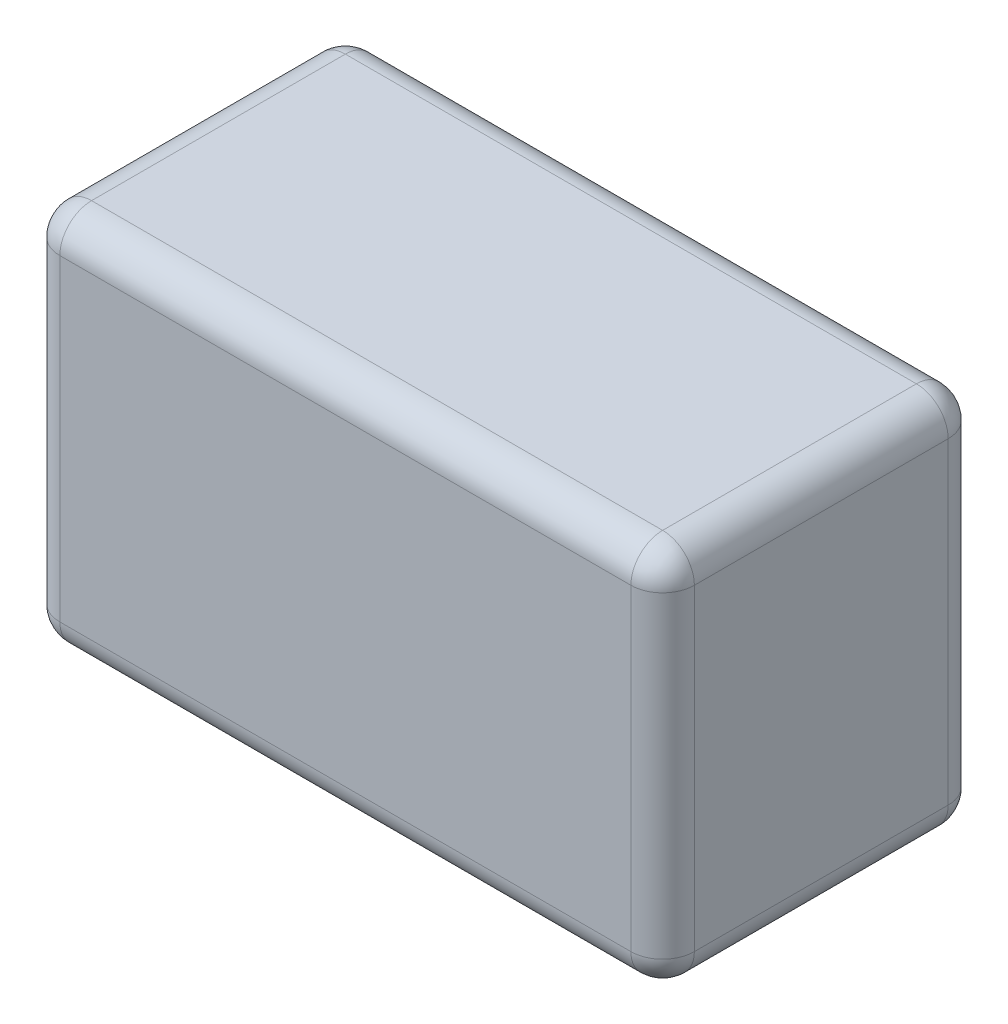
ISO-10303-21;
HEADER;
FILE_DESCRIPTION(('STEP AP214'),'2;1');
FILE_NAME('part.step','',(''),(''),'','','');
FILE_SCHEMA(('AUTOMOTIVE_DESIGN { 1 0 10303 214 1 1 1 1 }'));
ENDSEC;
DATA;
#1=APPLICATION_CONTEXT('core data for automotive mechanical design processes');
#2=APPLICATION_PROTOCOL_DEFINITION('international standard','automotive_design',2000,#1);
#3=PRODUCT_CONTEXT('',#1,'mechanical');
#4=PRODUCT('Part','Part','',(#3));
#5=PRODUCT_RELATED_PRODUCT_CATEGORY('part','',(#4));
#6=PRODUCT_DEFINITION_FORMATION('','',#4);
#7=PRODUCT_DEFINITION_CONTEXT('part definition',#1,'design');
#8=PRODUCT_DEFINITION('design','',#6,#7);
#9=PRODUCT_DEFINITION_SHAPE('','',#8);
#10=(LENGTH_UNIT() NAMED_UNIT(*) SI_UNIT(.MILLI.,.METRE.));
#11=(NAMED_UNIT(*) PLANE_ANGLE_UNIT() SI_UNIT($,.RADIAN.));
#12=(NAMED_UNIT(*) SI_UNIT($,.STERADIAN.) SOLID_ANGLE_UNIT());
#13=UNCERTAINTY_MEASURE_WITH_UNIT(LENGTH_MEASURE(1.E-05),#10,'distance_accuracy_value','');
#14=(GEOMETRIC_REPRESENTATION_CONTEXT(3) GLOBAL_UNCERTAINTY_ASSIGNED_CONTEXT((#13)) GLOBAL_UNIT_ASSIGNED_CONTEXT((#10,
#11,#12)) REPRESENTATION_CONTEXT('',''));
#15=CARTESIAN_POINT('',(0.,0.,0.));
#16=DIRECTION('',(0.,0.,1.));
#17=DIRECTION('',(1.,0.,0.));
#18=AXIS2_PLACEMENT_3D('',#15,#16,#17);
#19=CARTESIAN_POINT('',(0.45,0.55,0.2));
#20=DIRECTION('',(1.,0.,0.));
#21=DIRECTION('',(0.,0.,-1.));
#22=AXIS2_PLACEMENT_3D('',#19,#20,#21);
#23=SPHERICAL_SURFACE('',#22,0.05);
#24=CARTESIAN_POINT('',(0.45,0.55,0.2));
#25=DIRECTION('',(0.,-1.,0.));
#26=DIRECTION('',(0.,0.,-1.));
#27=AXIS2_PLACEMENT_3D('',#24,#25,#26);
#28=CIRCLE('',#27,0.05);
#29=CARTESIAN_POINT('',(0.5,0.55,0.2));
#30=VERTEX_POINT('',#29);
#31=CARTESIAN_POINT('',(0.45,0.55,0.25));
#32=VERTEX_POINT('',#31);
#33=EDGE_CURVE('E122',#30,#32,#28,.T.);
#34=ORIENTED_EDGE('',*,*,#33,.F.);
#35=CARTESIAN_POINT('',(0.45,0.55,0.2));
#36=DIRECTION('',(0.,0.,-1.));
#37=DIRECTION('',(-1.,0.,0.));
#38=AXIS2_PLACEMENT_3D('',#35,#36,#37);
#39=CIRCLE('',#38,0.05);
#40=CARTESIAN_POINT('',(0.45,0.6,0.2));
#41=VERTEX_POINT('',#40);
#42=EDGE_CURVE('E131',#41,#30,#39,.T.);
#43=ORIENTED_EDGE('',*,*,#42,.F.);
#44=CARTESIAN_POINT('',(0.45,0.55,0.2));
#45=DIRECTION('',(1.,0.,0.));
#46=DIRECTION('',(0.,0.,-1.));
#47=AXIS2_PLACEMENT_3D('',#44,#45,#46);
#48=CIRCLE('',#47,0.05);
#49=EDGE_CURVE('E111',#32,#41,#48,.F.);
#50=ORIENTED_EDGE('',*,*,#49,.F.);
#51=EDGE_LOOP('',(#34,#43,#50));
#52=FACE_BOUND('',#51,.T.);
#53=ADVANCED_FACE('F17',(#52),#23,.T.);
#54=CARTESIAN_POINT('',(-0.45,0.55,0.2));
#55=DIRECTION('',(1.,0.,0.));
#56=DIRECTION('',(0.,0.,-1.));
#57=AXIS2_PLACEMENT_3D('',#54,#55,#56);
#58=SPHERICAL_SURFACE('',#57,0.05);
#59=CARTESIAN_POINT('',(-0.45,0.55,0.2));
#60=DIRECTION('',(0.,-1.,0.));
#61=DIRECTION('',(0.,0.,-1.));
#62=AXIS2_PLACEMENT_3D('',#59,#60,#61);
#63=CIRCLE('',#62,0.05);
#64=CARTESIAN_POINT('',(-0.45,0.549999999999904,0.25));
#65=VERTEX_POINT('',#64);
#66=CARTESIAN_POINT('',(-0.5,0.55,0.2));
#67=VERTEX_POINT('',#66);
#68=EDGE_CURVE('E264',#65,#67,#63,.T.);
#69=ORIENTED_EDGE('',*,*,#68,.F.);
#70=CARTESIAN_POINT('',(-0.45,0.55,0.2));
#71=DIRECTION('',(1.,0.,0.));
#72=DIRECTION('',(0.,0.,-1.));
#73=AXIS2_PLACEMENT_3D('',#70,#71,#72);
#74=CIRCLE('',#73,0.05);
#75=CARTESIAN_POINT('',(-0.45,0.6,0.2));
#76=VERTEX_POINT('',#75);
#77=EDGE_CURVE('E114',#76,#65,#74,.T.);
#78=ORIENTED_EDGE('',*,*,#77,.F.);
#79=CARTESIAN_POINT('',(-0.45,0.55,0.2));
#80=DIRECTION('',(0.,0.,1.));
#81=DIRECTION('',(1.,0.,0.));
#82=AXIS2_PLACEMENT_3D('',#79,#80,#81);
#83=CIRCLE('',#82,0.05);
#84=EDGE_CURVE('E255',#67,#76,#83,.F.);
#85=ORIENTED_EDGE('',*,*,#84,.F.);
#86=EDGE_LOOP('',(#69,#78,#85));
#87=FACE_BOUND('',#86,.T.);
#88=ADVANCED_FACE('F151',(#87),#58,.T.);
#89=CARTESIAN_POINT('',(-0.45,0.05,0.2));
#90=DIRECTION('',(1.,0.,0.));
#91=DIRECTION('',(0.,0.,-1.));
#92=AXIS2_PLACEMENT_3D('',#89,#90,#91);
#93=SPHERICAL_SURFACE('',#92,0.05);
#94=CARTESIAN_POINT('',(-0.45,0.05,0.2));
#95=DIRECTION('',(0.,-1.,0.));
#96=DIRECTION('',(0.,0.,-1.));
#97=AXIS2_PLACEMENT_3D('',#94,#95,#96);
#98=CIRCLE('',#97,0.05);
#99=CARTESIAN_POINT('',(-0.5,0.05,0.2));
#100=VERTEX_POINT('',#99);
#101=CARTESIAN_POINT('',(-0.45,0.05,0.25));
#102=VERTEX_POINT('',#101);
#103=EDGE_CURVE('E261',#100,#102,#98,.F.);
#104=ORIENTED_EDGE('',*,*,#103,.F.);
#105=CARTESIAN_POINT('',(-0.45,0.05,0.2));
#106=DIRECTION('',(0.,0.,-1.));
#107=DIRECTION('',(-1.,0.,0.));
#108=AXIS2_PLACEMENT_3D('',#105,#106,#107);
#109=CIRCLE('',#108,0.05);
#110=CARTESIAN_POINT('',(-0.45,0.,0.199999999999952));
#111=VERTEX_POINT('',#110);
#112=EDGE_CURVE('E253',#111,#100,#109,.T.);
#113=ORIENTED_EDGE('',*,*,#112,.F.);
#114=CARTESIAN_POINT('',(-0.45,0.05,0.2));
#115=DIRECTION('',(-1.,0.,0.));
#116=DIRECTION('',(0.,0.,1.));
#117=AXIS2_PLACEMENT_3D('',#114,#115,#116);
#118=CIRCLE('',#117,0.05);
#119=EDGE_CURVE('E247',#102,#111,#118,.F.);
#120=ORIENTED_EDGE('',*,*,#119,.F.);
#121=EDGE_LOOP('',(#104,#113,#120));
#122=FACE_BOUND('',#121,.T.);
#123=ADVANCED_FACE('F147',(#122),#93,.T.);
#124=CARTESIAN_POINT('',(0.45,0.05,0.2));
#125=DIRECTION('',(1.,0.,0.));
#126=DIRECTION('',(0.,0.,-1.));
#127=AXIS2_PLACEMENT_3D('',#124,#125,#126);
#128=SPHERICAL_SURFACE('',#127,0.05);
#129=CARTESIAN_POINT('',(0.45,0.05,0.2));
#130=DIRECTION('',(-1.,0.,0.));
#131=DIRECTION('',(0.,0.,1.));
#132=AXIS2_PLACEMENT_3D('',#129,#130,#131);
#133=CIRCLE('',#132,0.05);
#134=CARTESIAN_POINT('',(0.45,0.,0.2));
#135=VERTEX_POINT('',#134);
#136=CARTESIAN_POINT('',(0.45,0.050000000000006,0.25));
#137=VERTEX_POINT('',#136);
#138=EDGE_CURVE('E245',#135,#137,#133,.T.);
#139=ORIENTED_EDGE('',*,*,#138,.F.);
#140=CARTESIAN_POINT('',(0.45,0.05,0.2));
#141=DIRECTION('',(0.,0.,1.));
#142=DIRECTION('',(1.,0.,0.));
#143=AXIS2_PLACEMENT_3D('',#140,#141,#142);
#144=CIRCLE('',#143,0.05);
#145=CARTESIAN_POINT('',(0.5,0.05,0.2));
#146=VERTEX_POINT('',#145);
#147=EDGE_CURVE('E250',#146,#135,#144,.F.);
#148=ORIENTED_EDGE('',*,*,#147,.F.);
#149=CARTESIAN_POINT('',(0.45,0.05,0.2));
#150=DIRECTION('',(0.,-1.,0.));
#151=DIRECTION('',(0.,0.,-1.));
#152=AXIS2_PLACEMENT_3D('',#149,#150,#151);
#153=CIRCLE('',#152,0.05);
#154=EDGE_CURVE('E133',#137,#146,#153,.F.);
#155=ORIENTED_EDGE('',*,*,#154,.F.);
#156=EDGE_LOOP('',(#139,#148,#155));
#157=FACE_BOUND('',#156,.T.);
#158=ADVANCED_FACE('F143',(#157),#128,.T.);
#159=CARTESIAN_POINT('',(0.45,0.6,0.2));
#160=DIRECTION('',(0.,-1.,0.));
#161=DIRECTION('',(0.,0.,-1.));
#162=AXIS2_PLACEMENT_3D('',#159,#160,#161);
#163=CYLINDRICAL_SURFACE('',#162,0.05);
#164=ORIENTED_EDGE('',*,*,#154,.T.);
#165=DIRECTION('',(0.,1.,0.));
#166=VECTOR('',#165,1.);
#167=CARTESIAN_POINT('',(0.5,0.6,0.2));
#168=LINE('',#167,#166);
#169=EDGE_CURVE('E127',#146,#30,#168,.T.);
#170=ORIENTED_EDGE('',*,*,#169,.T.);
#171=ORIENTED_EDGE('',*,*,#33,.T.);
#172=DIRECTION('',(0.,-1.,0.));
#173=VECTOR('',#172,1.);
#174=CARTESIAN_POINT('',(0.45,0.6,0.25));
#175=LINE('',#174,#173);
#176=EDGE_CURVE('E124',#32,#137,#175,.T.);
#177=ORIENTED_EDGE('',*,*,#176,.T.);
#178=EDGE_LOOP('',(#164,#170,#171,#177));
#179=FACE_BOUND('',#178,.T.);
#180=ADVANCED_FACE('F123',(#179),#163,.T.);
#181=CARTESIAN_POINT('',(0.45,0.55,-0.25));
#182=DIRECTION('',(0.,0.,-1.));
#183=DIRECTION('',(-1.,0.,0.));
#184=AXIS2_PLACEMENT_3D('',#181,#182,#183);
#185=CYLINDRICAL_SURFACE('',#184,0.05);
#186=CARTESIAN_POINT('',(0.45,0.55,-0.2));
#187=DIRECTION('',(0.,0.,1.));
#188=DIRECTION('',(1.,0.,0.));
#189=AXIS2_PLACEMENT_3D('',#186,#187,#188);
#190=CIRCLE('',#189,0.05);
#191=CARTESIAN_POINT('',(0.45,0.6,-0.2));
#192=VERTEX_POINT('',#191);
#193=CARTESIAN_POINT('',(0.5,0.55,-0.2));
#194=VERTEX_POINT('',#193);
#195=EDGE_CURVE('E236',#192,#194,#190,.F.);
#196=ORIENTED_EDGE('',*,*,#195,.F.);
#197=DIRECTION('',(0.,0.,-1.));
#198=VECTOR('',#197,1.);
#199=CARTESIAN_POINT('',(0.45,0.6,-0.25));
#200=LINE('',#199,#198);
#201=EDGE_CURVE('E116',#192,#41,#200,.F.);
#202=ORIENTED_EDGE('',*,*,#201,.T.);
#203=ORIENTED_EDGE('',*,*,#42,.T.);
#204=DIRECTION('',(0.,0.,1.));
#205=VECTOR('',#204,1.);
#206=CARTESIAN_POINT('',(0.5,0.55,0.25));
#207=LINE('',#206,#205);
#208=EDGE_CURVE('E117',#30,#194,#207,.F.);
#209=ORIENTED_EDGE('',*,*,#208,.T.);
#210=EDGE_LOOP('',(#196,#202,#203,#209));
#211=FACE_BOUND('',#210,.T.);
#212=ADVANCED_FACE('F269',(#211),#185,.T.);
#213=CARTESIAN_POINT('',(-0.45,0.6,0.2));
#214=DIRECTION('',(0.,-1.,0.));
#215=DIRECTION('',(0.,0.,-1.));
#216=AXIS2_PLACEMENT_3D('',#213,#214,#215);
#217=CYLINDRICAL_SURFACE('',#216,0.05);
#218=ORIENTED_EDGE('',*,*,#103,.T.);
#219=DIRECTION('',(0.,-1.,0.));
#220=VECTOR('',#219,1.);
#221=CARTESIAN_POINT('',(-0.45,0.6,0.25));
#222=LINE('',#221,#220);
#223=EDGE_CURVE('E258',#102,#65,#222,.F.);
#224=ORIENTED_EDGE('',*,*,#223,.T.);
#225=ORIENTED_EDGE('',*,*,#68,.T.);
#226=DIRECTION('',(0.,1.,0.));
#227=VECTOR('',#226,1.);
#228=CARTESIAN_POINT('',(-0.5,0.6,0.2));
#229=LINE('',#228,#227);
#230=EDGE_CURVE('E353',#67,#100,#229,.F.);
#231=ORIENTED_EDGE('',*,*,#230,.T.);
#232=EDGE_LOOP('',(#218,#224,#225,#231));
#233=FACE_BOUND('',#232,.T.);
#234=ADVANCED_FACE('F358',(#233),#217,.T.);
#235=CARTESIAN_POINT('',(-0.45,0.55,-0.25));
#236=DIRECTION('',(0.,0.,1.));
#237=DIRECTION('',(1.,0.,0.));
#238=AXIS2_PLACEMENT_3D('',#235,#236,#237);
#239=CYLINDRICAL_SURFACE('',#238,0.05);
#240=CARTESIAN_POINT('',(-0.45,0.55,-0.2));
#241=DIRECTION('',(0.,0.,1.));
#242=DIRECTION('',(1.,0.,0.));
#243=AXIS2_PLACEMENT_3D('',#240,#241,#242);
#244=CIRCLE('',#243,0.05);
#245=CARTESIAN_POINT('',(-0.5,0.55,-0.2));
#246=VERTEX_POINT('',#245);
#247=CARTESIAN_POINT('',(-0.45,0.6,-0.2));
#248=VERTEX_POINT('',#247);
#249=EDGE_CURVE('E213',#246,#248,#244,.F.);
#250=ORIENTED_EDGE('',*,*,#249,.F.);
#251=DIRECTION('',(0.,0.,-1.));
#252=VECTOR('',#251,1.);
#253=CARTESIAN_POINT('',(-0.5,0.55,0.25));
#254=LINE('',#253,#252);
#255=EDGE_CURVE('E355',#246,#67,#254,.F.);
#256=ORIENTED_EDGE('',*,*,#255,.T.);
#257=ORIENTED_EDGE('',*,*,#84,.T.);
#258=DIRECTION('',(0.,0.,-1.));
#259=VECTOR('',#258,1.);
#260=CARTESIAN_POINT('',(-0.45,0.6,-0.25));
#261=LINE('',#260,#259);
#262=EDGE_CURVE('E234',#76,#248,#261,.T.);
#263=ORIENTED_EDGE('',*,*,#262,.T.);
#264=EDGE_LOOP('',(#250,#256,#257,#263));
#265=FACE_BOUND('',#264,.T.);
#266=ADVANCED_FACE('F361',(#265),#239,.T.);
#267=CARTESIAN_POINT('',(-0.45,0.05,0.25));
#268=DIRECTION('',(0.,0.,-1.));
#269=DIRECTION('',(-1.,0.,0.));
#270=AXIS2_PLACEMENT_3D('',#267,#268,#269);
#271=CYLINDRICAL_SURFACE('',#270,0.05);
#272=CARTESIAN_POINT('',(-0.45,0.05,-0.2));
#273=DIRECTION('',(0.,0.,-1.));
#274=DIRECTION('',(1.,0.,0.));
#275=AXIS2_PLACEMENT_3D('',#272,#273,#274);
#276=CIRCLE('',#275,0.05);
#277=CARTESIAN_POINT('',(-0.45,0.,-0.2));
#278=VERTEX_POINT('',#277);
#279=CARTESIAN_POINT('',(-0.5,0.05,-0.2));
#280=VERTEX_POINT('',#279);
#281=EDGE_CURVE('E209',#278,#280,#276,.T.);
#282=ORIENTED_EDGE('',*,*,#281,.F.);
#283=DIRECTION('',(0.,0.,-1.));
#284=VECTOR('',#283,1.);
#285=CARTESIAN_POINT('',(-0.45,0.,-0.25));
#286=LINE('',#285,#284);
#287=EDGE_CURVE('E205',#111,#278,#286,.T.);
#288=ORIENTED_EDGE('',*,*,#287,.F.);
#289=ORIENTED_EDGE('',*,*,#112,.T.);
#290=DIRECTION('',(0.,0.,-1.));
#291=VECTOR('',#290,1.);
#292=CARTESIAN_POINT('',(-0.5,0.05,0.25));
#293=LINE('',#292,#291);
#294=EDGE_CURVE('E307',#100,#280,#293,.T.);
#295=ORIENTED_EDGE('',*,*,#294,.T.);
#296=EDGE_LOOP('',(#282,#288,#289,#295));
#297=FACE_BOUND('',#296,.T.);
#298=ADVANCED_FACE('F305',(#297),#271,.T.);
#299=CARTESIAN_POINT('',(0.45,0.05,0.25));
#300=DIRECTION('',(0.,0.,1.));
#301=DIRECTION('',(1.,0.,0.));
#302=AXIS2_PLACEMENT_3D('',#299,#300,#301);
#303=CYLINDRICAL_SURFACE('',#302,0.05);
#304=CARTESIAN_POINT('',(0.45,0.05,-0.2));
#305=DIRECTION('',(0.,-1.91687272673274E-12,-1.));
#306=DIRECTION('',(1.,0.,0.));
#307=AXIS2_PLACEMENT_3D('',#304,#305,#306);
#308=CIRCLE('',#307,0.05);
#309=CARTESIAN_POINT('',(0.5,0.05,-0.2));
#310=VERTEX_POINT('',#309);
#311=CARTESIAN_POINT('',(0.45,0.,-0.199999999999988));
#312=VERTEX_POINT('',#311);
#313=EDGE_CURVE('E207',#310,#312,#308,.T.);
#314=ORIENTED_EDGE('',*,*,#313,.F.);
#315=DIRECTION('',(0.,0.,1.));
#316=VECTOR('',#315,1.);
#317=CARTESIAN_POINT('',(0.5,0.05,0.25));
#318=LINE('',#317,#316);
#319=EDGE_CURVE('E242',#310,#146,#318,.T.);
#320=ORIENTED_EDGE('',*,*,#319,.T.);
#321=ORIENTED_EDGE('',*,*,#147,.T.);
#322=DIRECTION('',(0.,0.,-1.));
#323=VECTOR('',#322,1.);
#324=CARTESIAN_POINT('',(0.45,0.,-0.25));
#325=LINE('',#324,#323);
#326=EDGE_CURVE('E294',#312,#135,#325,.F.);
#327=ORIENTED_EDGE('',*,*,#326,.F.);
#328=EDGE_LOOP('',(#314,#320,#321,#327));
#329=FACE_BOUND('',#328,.T.);
#330=ADVANCED_FACE('F344',(#329),#303,.T.);
#331=CARTESIAN_POINT('',(-0.5,0.6,0.25));
#332=DIRECTION('',(0.,0.,-1.));
#333=DIRECTION('',(-1.,0.,0.));
#334=AXIS2_PLACEMENT_3D('',#331,#332,#333);
#335=PLANE('',#334);
#336=DIRECTION('',(1.,0.,0.));
#337=VECTOR('',#336,1.);
#338=CARTESIAN_POINT('',(0.5,0.55,0.25));
#339=LINE('',#338,#337);
#340=EDGE_CURVE('E107',#65,#32,#339,.T.);
#341=ORIENTED_EDGE('',*,*,#340,.F.);
#342=ORIENTED_EDGE('',*,*,#223,.F.);
#343=DIRECTION('',(-1.,0.,0.));
#344=VECTOR('',#343,1.);
#345=CARTESIAN_POINT('',(-0.5,0.05,0.25));
#346=LINE('',#345,#344);
#347=EDGE_CURVE('E101',#137,#102,#346,.T.);
#348=ORIENTED_EDGE('',*,*,#347,.F.);
#349=ORIENTED_EDGE('',*,*,#176,.F.);
#350=EDGE_LOOP('',(#341,#342,#348,#349));
#351=FACE_BOUND('',#350,.T.);
#352=ADVANCED_FACE('F135',(#351),#335,.F.);
#353=CARTESIAN_POINT('',(0.5,0.6,0.25));
#354=DIRECTION('',(-1.,0.,0.));
#355=DIRECTION('',(0.,0.,1.));
#356=AXIS2_PLACEMENT_3D('',#353,#354,#355);
#357=PLANE('',#356);
#358=ORIENTED_EDGE('',*,*,#208,.F.);
#359=ORIENTED_EDGE('',*,*,#169,.F.);
#360=ORIENTED_EDGE('',*,*,#319,.F.);
#361=DIRECTION('',(0.,-1.,0.));
#362=VECTOR('',#361,1.);
#363=CARTESIAN_POINT('',(0.5,0.6,-0.2));
#364=LINE('',#363,#362);
#365=EDGE_CURVE('E285',#194,#310,#364,.T.);
#366=ORIENTED_EDGE('',*,*,#365,.F.);
#367=EDGE_LOOP('',(#358,#359,#360,#366));
#368=FACE_BOUND('',#367,.T.);
#369=ADVANCED_FACE('F440',(#368),#357,.F.);
#370=CARTESIAN_POINT('',(0.5,0.55,0.2));
#371=DIRECTION('',(1.,0.,0.));
#372=DIRECTION('',(0.,0.,-1.));
#373=AXIS2_PLACEMENT_3D('',#370,#371,#372);
#374=CYLINDRICAL_SURFACE('',#373,0.05);
#375=ORIENTED_EDGE('',*,*,#340,.T.);
#376=ORIENTED_EDGE('',*,*,#49,.T.);
#377=DIRECTION('',(1.,0.,0.));
#378=VECTOR('',#377,1.);
#379=CARTESIAN_POINT('',(0.5,0.6,0.2));
#380=LINE('',#379,#378);
#381=EDGE_CURVE('E276',#41,#76,#380,.F.);
#382=ORIENTED_EDGE('',*,*,#381,.T.);
#383=ORIENTED_EDGE('',*,*,#77,.T.);
#384=EDGE_LOOP('',(#375,#376,#382,#383));
#385=FACE_BOUND('',#384,.T.);
#386=ADVANCED_FACE('F109',(#385),#374,.T.);
#387=CARTESIAN_POINT('',(0.45,0.55,-0.2));
#388=DIRECTION('',(1.,0.,0.));
#389=DIRECTION('',(0.,0.,-1.));
#390=AXIS2_PLACEMENT_3D('',#387,#388,#389);
#391=SPHERICAL_SURFACE('',#390,0.05);
#392=ORIENTED_EDGE('',*,*,#195,.T.);
#393=CARTESIAN_POINT('',(0.45,0.55,-0.2));
#394=DIRECTION('',(0.,-1.,0.));
#395=DIRECTION('',(0.,0.,-1.));
#396=AXIS2_PLACEMENT_3D('',#393,#394,#395);
#397=CIRCLE('',#396,0.05);
#398=CARTESIAN_POINT('',(0.45,0.55,-0.25));
#399=VERTEX_POINT('',#398);
#400=EDGE_CURVE('E291',#399,#194,#397,.T.);
#401=ORIENTED_EDGE('',*,*,#400,.F.);
#402=CARTESIAN_POINT('',(0.45,0.55,-0.2));
#403=DIRECTION('',(-1.,0.,0.));
#404=DIRECTION('',(0.,0.,1.));
#405=AXIS2_PLACEMENT_3D('',#402,#403,#404);
#406=CIRCLE('',#405,0.05);
#407=EDGE_CURVE('E278',#192,#399,#406,.T.);
#408=ORIENTED_EDGE('',*,*,#407,.F.);
#409=EDGE_LOOP('',(#392,#401,#408));
#410=FACE_BOUND('',#409,.T.);
#411=ADVANCED_FACE('F224',(#410),#391,.T.);
#412=CARTESIAN_POINT('',(-0.5,0.6,0.25));
#413=DIRECTION('',(1.,0.,0.));
#414=DIRECTION('',(0.,0.,-1.));
#415=AXIS2_PLACEMENT_3D('',#412,#413,#414);
#416=PLANE('',#415);
#417=ORIENTED_EDGE('',*,*,#255,.F.);
#418=DIRECTION('',(0.,-1.,0.));
#419=VECTOR('',#418,1.);
#420=CARTESIAN_POINT('',(-0.5,0.6,-0.2));
#421=LINE('',#420,#419);
#422=EDGE_CURVE('E321',#280,#246,#421,.F.);
#423=ORIENTED_EDGE('',*,*,#422,.F.);
#424=ORIENTED_EDGE('',*,*,#294,.F.);
#425=ORIENTED_EDGE('',*,*,#230,.F.);
#426=EDGE_LOOP('',(#417,#423,#424,#425));
#427=FACE_BOUND('',#426,.T.);
#428=ADVANCED_FACE('F220',(#427),#416,.F.);
#429=CARTESIAN_POINT('',(-0.45,0.55,-0.2));
#430=DIRECTION('',(1.,0.,0.));
#431=DIRECTION('',(0.,0.,-1.));
#432=AXIS2_PLACEMENT_3D('',#429,#430,#431);
#433=SPHERICAL_SURFACE('',#432,0.05);
#434=ORIENTED_EDGE('',*,*,#249,.T.);
#435=CARTESIAN_POINT('',(-0.45,0.55,-0.2));
#436=DIRECTION('',(-1.,0.,0.));
#437=DIRECTION('',(0.,0.,1.));
#438=AXIS2_PLACEMENT_3D('',#435,#436,#437);
#439=CIRCLE('',#438,0.05);
#440=CARTESIAN_POINT('',(-0.45,0.55,-0.25));
#441=VERTEX_POINT('',#440);
#442=EDGE_CURVE('E282',#441,#248,#439,.F.);
#443=ORIENTED_EDGE('',*,*,#442,.F.);
#444=CARTESIAN_POINT('',(-0.45,0.55,-0.2));
#445=DIRECTION('',(0.,-1.,0.));
#446=DIRECTION('',(0.,0.,-1.));
#447=AXIS2_PLACEMENT_3D('',#444,#445,#446);
#448=CIRCLE('',#447,0.05);
#449=EDGE_CURVE('E316',#246,#441,#448,.T.);
#450=ORIENTED_EDGE('',*,*,#449,.F.);
#451=EDGE_LOOP('',(#434,#443,#450));
#452=FACE_BOUND('',#451,.T.);
#453=ADVANCED_FACE('F217',(#452),#433,.T.);
#454=CARTESIAN_POINT('',(-0.45,0.05,-0.2));
#455=DIRECTION('',(1.,0.,0.));
#456=DIRECTION('',(0.,0.,-1.));
#457=AXIS2_PLACEMENT_3D('',#454,#455,#456);
#458=SPHERICAL_SURFACE('',#457,0.05);
#459=CARTESIAN_POINT('',(-0.45,0.05,-0.2));
#460=DIRECTION('',(0.,-1.,0.));
#461=DIRECTION('',(0.,0.,-1.));
#462=AXIS2_PLACEMENT_3D('',#459,#460,#461);
#463=CIRCLE('',#462,0.05);
#464=CARTESIAN_POINT('',(-0.45,0.05,-0.25));
#465=VERTEX_POINT('',#464);
#466=EDGE_CURVE('E313',#465,#280,#463,.F.);
#467=ORIENTED_EDGE('',*,*,#466,.F.);
#468=CARTESIAN_POINT('',(-0.45,0.05,-0.2));
#469=DIRECTION('',(1.,0.,0.));
#470=DIRECTION('',(0.,0.,-1.));
#471=AXIS2_PLACEMENT_3D('',#468,#469,#470);
#472=CIRCLE('',#471,0.05);
#473=EDGE_CURVE('E312',#278,#465,#472,.T.);
#474=ORIENTED_EDGE('',*,*,#473,.F.);
#475=ORIENTED_EDGE('',*,*,#281,.T.);
#476=EDGE_LOOP('',(#467,#474,#475));
#477=FACE_BOUND('',#476,.T.);
#478=ADVANCED_FACE('F198',(#477),#458,.T.);
#479=CARTESIAN_POINT('',(0.45,0.05,-0.2));
#480=DIRECTION('',(1.,0.,0.));
#481=DIRECTION('',(0.,0.,-1.));
#482=AXIS2_PLACEMENT_3D('',#479,#480,#481);
#483=SPHERICAL_SURFACE('',#482,0.05);
#484=CARTESIAN_POINT('',(0.45,0.05,-0.2));
#485=DIRECTION('',(1.,0.,0.));
#486=DIRECTION('',(0.,0.,-1.));
#487=AXIS2_PLACEMENT_3D('',#484,#485,#486);
#488=CIRCLE('',#487,0.05);
#489=CARTESIAN_POINT('',(0.45,0.05,-0.25));
#490=VERTEX_POINT('',#489);
#491=EDGE_CURVE('E315',#490,#312,#488,.F.);
#492=ORIENTED_EDGE('',*,*,#491,.F.);
#493=CARTESIAN_POINT('',(0.45,0.05,-0.2));
#494=DIRECTION('',(0.,-1.,0.));
#495=DIRECTION('',(0.,0.,-1.));
#496=AXIS2_PLACEMENT_3D('',#493,#494,#495);
#497=CIRCLE('',#496,0.05);
#498=EDGE_CURVE('E279',#310,#490,#497,.F.);
#499=ORIENTED_EDGE('',*,*,#498,.F.);
#500=ORIENTED_EDGE('',*,*,#313,.T.);
#501=EDGE_LOOP('',(#492,#499,#500));
#502=FACE_BOUND('',#501,.T.);
#503=ADVANCED_FACE('F193',(#502),#483,.T.);
#504=CARTESIAN_POINT('',(-0.5,0.05,0.2));
#505=DIRECTION('',(-1.,0.,0.));
#506=DIRECTION('',(0.,0.,1.));
#507=AXIS2_PLACEMENT_3D('',#504,#505,#506);
#508=CYLINDRICAL_SURFACE('',#507,0.05);
#509=DIRECTION('',(1.,0.,0.));
#510=VECTOR('',#509,1.);
#511=CARTESIAN_POINT('',(0.5,0.,0.2));
#512=LINE('',#511,#510);
#513=EDGE_CURVE('E301',#135,#111,#512,.F.);
#514=ORIENTED_EDGE('',*,*,#513,.F.);
#515=ORIENTED_EDGE('',*,*,#138,.T.);
#516=ORIENTED_EDGE('',*,*,#347,.T.);
#517=ORIENTED_EDGE('',*,*,#119,.T.);
#518=EDGE_LOOP('',(#514,#515,#516,#517));
#519=FACE_BOUND('',#518,.T.);
#520=ADVANCED_FACE('F189',(#519),#508,.T.);
#521=CARTESIAN_POINT('',(0.45,0.6,-0.2));
#522=DIRECTION('',(0.,-1.,0.));
#523=DIRECTION('',(0.,0.,-1.));
#524=AXIS2_PLACEMENT_3D('',#521,#522,#523);
#525=CYLINDRICAL_SURFACE('',#524,0.05);
#526=ORIENTED_EDGE('',*,*,#498,.T.);
#527=DIRECTION('',(0.,1.,0.));
#528=VECTOR('',#527,1.);
#529=CARTESIAN_POINT('',(0.45,0.6,-0.25));
#530=LINE('',#529,#528);
#531=EDGE_CURVE('E334',#490,#399,#530,.T.);
#532=ORIENTED_EDGE('',*,*,#531,.T.);
#533=ORIENTED_EDGE('',*,*,#400,.T.);
#534=ORIENTED_EDGE('',*,*,#365,.T.);
#535=EDGE_LOOP('',(#526,#532,#533,#534));
#536=FACE_BOUND('',#535,.T.);
#537=ADVANCED_FACE('F185',(#536),#525,.T.);
#538=CARTESIAN_POINT('',(0.5,0.6,-0.25));
#539=DIRECTION('',(0.,-1.,0.));
#540=DIRECTION('',(0.,0.,-1.));
#541=AXIS2_PLACEMENT_3D('',#538,#539,#540);
#542=PLANE('',#541);
#543=DIRECTION('',(-1.,0.,0.));
#544=VECTOR('',#543,1.);
#545=CARTESIAN_POINT('',(0.5,0.6,-0.2));
#546=LINE('',#545,#544);
#547=EDGE_CURVE('E274',#248,#192,#546,.F.);
#548=ORIENTED_EDGE('',*,*,#547,.F.);
#549=ORIENTED_EDGE('',*,*,#262,.F.);
#550=ORIENTED_EDGE('',*,*,#381,.F.);
#551=ORIENTED_EDGE('',*,*,#201,.F.);
#552=EDGE_LOOP('',(#548,#549,#550,#551));
#553=FACE_BOUND('',#552,.T.);
#554=ADVANCED_FACE('F181',(#553),#542,.F.);
#555=CARTESIAN_POINT('',(-0.45,0.6,-0.2));
#556=DIRECTION('',(0.,-1.,0.));
#557=DIRECTION('',(0.,0.,-1.));
#558=AXIS2_PLACEMENT_3D('',#555,#556,#557);
#559=CYLINDRICAL_SURFACE('',#558,0.05);
#560=ORIENTED_EDGE('',*,*,#449,.T.);
#561=DIRECTION('',(0.,1.,0.));
#562=VECTOR('',#561,1.);
#563=CARTESIAN_POINT('',(-0.45,0.6,-0.25));
#564=LINE('',#563,#562);
#565=EDGE_CURVE('E331',#441,#465,#564,.F.);
#566=ORIENTED_EDGE('',*,*,#565,.T.);
#567=ORIENTED_EDGE('',*,*,#466,.T.);
#568=ORIENTED_EDGE('',*,*,#422,.T.);
#569=EDGE_LOOP('',(#560,#566,#567,#568));
#570=FACE_BOUND('',#569,.T.);
#571=ADVANCED_FACE('F177',(#570),#559,.T.);
#572=CARTESIAN_POINT('',(0.5,0.,-0.25));
#573=DIRECTION('',(0.,-1.,0.));
#574=DIRECTION('',(0.,0.,-1.));
#575=AXIS2_PLACEMENT_3D('',#572,#573,#574);
#576=PLANE('',#575);
#577=DIRECTION('',(1.,0.,0.));
#578=VECTOR('',#577,1.);
#579=CARTESIAN_POINT('',(-0.5,0.,-0.2));
#580=LINE('',#579,#578);
#581=EDGE_CURVE('E300',#312,#278,#580,.F.);
#582=ORIENTED_EDGE('',*,*,#581,.F.);
#583=ORIENTED_EDGE('',*,*,#326,.T.);
#584=ORIENTED_EDGE('',*,*,#513,.T.);
#585=ORIENTED_EDGE('',*,*,#287,.T.);
#586=EDGE_LOOP('',(#582,#583,#584,#585));
#587=FACE_BOUND('',#586,.T.);
#588=ADVANCED_FACE('F173',(#587),#576,.T.);
#589=CARTESIAN_POINT('',(0.5,0.55,-0.2));
#590=DIRECTION('',(-1.,0.,0.));
#591=DIRECTION('',(0.,0.,1.));
#592=AXIS2_PLACEMENT_3D('',#589,#590,#591);
#593=CYLINDRICAL_SURFACE('',#592,0.05);
#594=ORIENTED_EDGE('',*,*,#547,.T.);
#595=ORIENTED_EDGE('',*,*,#407,.T.);
#596=DIRECTION('',(1.,0.,0.));
#597=VECTOR('',#596,1.);
#598=CARTESIAN_POINT('',(-0.5,0.55,-0.25));
#599=LINE('',#598,#597);
#600=EDGE_CURVE('E26',#399,#441,#599,.F.);
#601=ORIENTED_EDGE('',*,*,#600,.T.);
#602=ORIENTED_EDGE('',*,*,#442,.T.);
#603=EDGE_LOOP('',(#594,#595,#601,#602));
#604=FACE_BOUND('',#603,.T.);
#605=ADVANCED_FACE('F167',(#604),#593,.T.);
#606=CARTESIAN_POINT('',(-0.5,0.05,-0.2));
#607=DIRECTION('',(1.,0.,0.));
#608=DIRECTION('',(0.,0.,-1.));
#609=AXIS2_PLACEMENT_3D('',#606,#607,#608);
#610=CYLINDRICAL_SURFACE('',#609,0.05);
#611=DIRECTION('',(1.,0.,0.));
#612=VECTOR('',#611,1.);
#613=CARTESIAN_POINT('',(-0.5,0.05,-0.25));
#614=LINE('',#613,#612);
#615=EDGE_CURVE('E11',#465,#490,#614,.T.);
#616=ORIENTED_EDGE('',*,*,#615,.T.);
#617=ORIENTED_EDGE('',*,*,#491,.T.);
#618=ORIENTED_EDGE('',*,*,#581,.T.);
#619=ORIENTED_EDGE('',*,*,#473,.T.);
#620=EDGE_LOOP('',(#616,#617,#618,#619));
#621=FACE_BOUND('',#620,.T.);
#622=ADVANCED_FACE('F162',(#621),#610,.T.);
#623=CARTESIAN_POINT('',(-0.5,0.6,-0.25));
#624=DIRECTION('',(0.,0.,1.));
#625=DIRECTION('',(1.,0.,0.));
#626=AXIS2_PLACEMENT_3D('',#623,#624,#625);
#627=PLANE('',#626);
#628=ORIENTED_EDGE('',*,*,#615,.F.);
#629=ORIENTED_EDGE('',*,*,#565,.F.);
#630=ORIENTED_EDGE('',*,*,#600,.F.);
#631=ORIENTED_EDGE('',*,*,#531,.F.);
#632=EDGE_LOOP('',(#628,#629,#630,#631));
#633=FACE_BOUND('',#632,.T.);
#634=ADVANCED_FACE('F160',(#633),#627,.F.);
#635=CLOSED_SHELL('',(#53,#88,#123,#158,#180,#212,#234,#266,#298,#330,#352,#369,#386,#411,#428,
#453,#478,#503,#520,#537,#554,#571,#588,#605,#622,#634));
#636=MANIFOLD_SOLID_BREP('B1',#635);
#637=ADVANCED_BREP_SHAPE_REPRESENTATION('',(#18,#636),#14);
#638=SHAPE_DEFINITION_REPRESENTATION(#9,#637);
ENDSEC;
END-ISO-10303-21;
